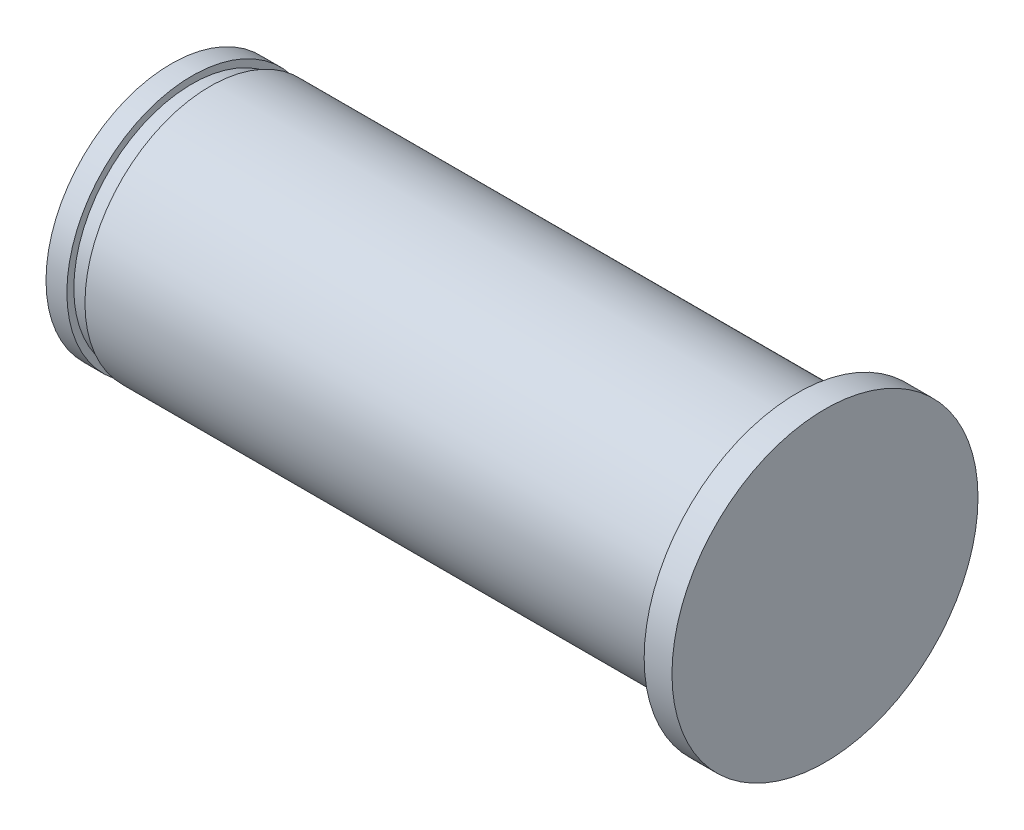
ISO-10303-21;
HEADER;
FILE_DESCRIPTION(('STEP AP214'),'2;1');
FILE_NAME('part.step','',(''),(''),'','','');
FILE_SCHEMA(('AUTOMOTIVE_DESIGN { 1 0 10303 214 1 1 1 1 }'));
ENDSEC;
DATA;
#1=APPLICATION_CONTEXT('core data for automotive mechanical design processes');
#2=APPLICATION_PROTOCOL_DEFINITION('international standard','automotive_design',2000,#1);
#3=PRODUCT_CONTEXT('',#1,'mechanical');
#4=PRODUCT('Part','Part','',(#3));
#5=PRODUCT_RELATED_PRODUCT_CATEGORY('part','',(#4));
#6=PRODUCT_DEFINITION_FORMATION('','',#4);
#7=PRODUCT_DEFINITION_CONTEXT('part definition',#1,'design');
#8=PRODUCT_DEFINITION('design','',#6,#7);
#9=PRODUCT_DEFINITION_SHAPE('','',#8);
#10=(LENGTH_UNIT() NAMED_UNIT(*) SI_UNIT(.MILLI.,.METRE.));
#11=(NAMED_UNIT(*) PLANE_ANGLE_UNIT() SI_UNIT($,.RADIAN.));
#12=(NAMED_UNIT(*) SI_UNIT($,.STERADIAN.) SOLID_ANGLE_UNIT());
#13=UNCERTAINTY_MEASURE_WITH_UNIT(LENGTH_MEASURE(1.E-05),#10,'distance_accuracy_value','');
#14=(GEOMETRIC_REPRESENTATION_CONTEXT(3) GLOBAL_UNCERTAINTY_ASSIGNED_CONTEXT((#13)) GLOBAL_UNIT_ASSIGNED_CONTEXT((#10,
#11,#12)) REPRESENTATION_CONTEXT('',''));
#15=CARTESIAN_POINT('',(0.,0.,0.));
#16=DIRECTION('',(0.,0.,1.));
#17=DIRECTION('',(1.,0.,0.));
#18=AXIS2_PLACEMENT_3D('',#15,#16,#17);
#19=CARTESIAN_POINT('',(0.,0.,0.));
#20=DIRECTION('',(1.,0.,0.));
#21=DIRECTION('',(0.,0.,-1.));
#22=AXIS2_PLACEMENT_3D('',#19,#20,#21);
#23=PLANE('',#22);
#24=CARTESIAN_POINT('',(0.,0.,0.));
#25=DIRECTION('',(-1.,0.,0.));
#26=DIRECTION('',(0.,0.,1.));
#27=AXIS2_PLACEMENT_3D('',#24,#25,#26);
#28=CIRCLE('',#27,9.);
#29=CARTESIAN_POINT('',(0.,0.,9.));
#30=VERTEX_POINT('',#29);
#31=EDGE_CURVE('E10',#30,#30,#28,.T.);
#32=ORIENTED_EDGE('',*,*,#31,.T.);
#33=EDGE_LOOP('',(#32));
#34=FACE_BOUND('',#33,.T.);
#35=ADVANCED_FACE('F43',(#34),#23,.F.);
#36=CARTESIAN_POINT('',(-20.4031201273256,0.,0.));
#37=DIRECTION('',(-1.,0.,0.));
#38=DIRECTION('',(0.,0.,1.));
#39=AXIS2_PLACEMENT_3D('',#36,#37,#38);
#40=CYLINDRICAL_SURFACE('',#39,9.);
#41=ORIENTED_EDGE('',*,*,#31,.F.);
#42=EDGE_LOOP('',(#41));
#43=FACE_BOUND('',#42,.T.);
#44=CARTESIAN_POINT('',(1.5,0.,0.));
#45=DIRECTION('',(-1.,0.,0.));
#46=DIRECTION('',(0.,0.,1.));
#47=AXIS2_PLACEMENT_3D('',#44,#45,#46);
#48=CIRCLE('',#47,9.);
#49=CARTESIAN_POINT('',(1.5,0.,9.));
#50=VERTEX_POINT('',#49);
#51=EDGE_CURVE('E50',#50,#50,#48,.T.);
#52=ORIENTED_EDGE('',*,*,#51,.T.);
#53=EDGE_LOOP('',(#52));
#54=FACE_BOUND('',#53,.T.);
#55=ADVANCED_FACE('F95',(#43,#54),#40,.T.);
#56=CARTESIAN_POINT('',(1.5,9.,0.));
#57=DIRECTION('',(-1.,0.,0.));
#58=DIRECTION('',(0.,0.,1.));
#59=AXIS2_PLACEMENT_3D('',#56,#57,#58);
#60=PLANE('',#59);
#61=ORIENTED_EDGE('',*,*,#51,.F.);
#62=EDGE_LOOP('',(#61));
#63=FACE_BOUND('',#62,.T.);
#64=CARTESIAN_POINT('',(1.5,0.,0.));
#65=DIRECTION('',(-1.,0.,0.));
#66=DIRECTION('',(0.,0.,1.));
#67=AXIS2_PLACEMENT_3D('',#64,#65,#66);
#68=CIRCLE('',#67,8.5);
#69=CARTESIAN_POINT('',(1.5,0.,8.5));
#70=VERTEX_POINT('',#69);
#71=EDGE_CURVE('E55',#70,#70,#68,.T.);
#72=ORIENTED_EDGE('',*,*,#71,.T.);
#73=EDGE_LOOP('',(#72));
#74=FACE_BOUND('',#73,.T.);
#75=ADVANCED_FACE('F99',(#63,#74),#60,.F.);
#76=CARTESIAN_POINT('',(-20.4031201273256,0.,0.));
#77=DIRECTION('',(-1.,0.,0.));
#78=DIRECTION('',(0.,0.,1.));
#79=AXIS2_PLACEMENT_3D('',#76,#77,#78);
#80=CYLINDRICAL_SURFACE('',#79,8.5);
#81=ORIENTED_EDGE('',*,*,#71,.F.);
#82=EDGE_LOOP('',(#81));
#83=FACE_BOUND('',#82,.T.);
#84=CARTESIAN_POINT('',(2.8,0.,0.));
#85=DIRECTION('',(-1.,0.,0.));
#86=DIRECTION('',(0.,0.,1.));
#87=AXIS2_PLACEMENT_3D('',#84,#85,#86);
#88=CIRCLE('',#87,8.5);
#89=CARTESIAN_POINT('',(2.8,0.,8.5));
#90=VERTEX_POINT('',#89);
#91=EDGE_CURVE('E60',#90,#90,#88,.T.);
#92=ORIENTED_EDGE('',*,*,#91,.T.);
#93=EDGE_LOOP('',(#92));
#94=FACE_BOUND('',#93,.T.);
#95=ADVANCED_FACE('F104',(#83,#94),#80,.T.);
#96=CARTESIAN_POINT('',(2.8,8.5,0.));
#97=DIRECTION('',(1.,0.,0.));
#98=DIRECTION('',(0.,0.,-1.));
#99=AXIS2_PLACEMENT_3D('',#96,#97,#98);
#100=PLANE('',#99);
#101=ORIENTED_EDGE('',*,*,#91,.F.);
#102=EDGE_LOOP('',(#101));
#103=FACE_BOUND('',#102,.T.);
#104=CARTESIAN_POINT('',(2.8,0.,0.));
#105=DIRECTION('',(-1.,0.,0.));
#106=DIRECTION('',(0.,0.,1.));
#107=AXIS2_PLACEMENT_3D('',#104,#105,#106);
#108=CIRCLE('',#107,9.);
#109=CARTESIAN_POINT('',(2.8,0.,9.));
#110=VERTEX_POINT('',#109);
#111=EDGE_CURVE('E66',#110,#110,#108,.T.);
#112=ORIENTED_EDGE('',*,*,#111,.T.);
#113=EDGE_LOOP('',(#112));
#114=FACE_BOUND('',#113,.T.);
#115=ADVANCED_FACE('F110',(#103,#114),#100,.F.);
#116=CARTESIAN_POINT('',(-20.4031201273256,0.,0.));
#117=DIRECTION('',(-1.,0.,0.));
#118=DIRECTION('',(0.,0.,1.));
#119=AXIS2_PLACEMENT_3D('',#116,#117,#118);
#120=CYLINDRICAL_SURFACE('',#119,9.);
#121=ORIENTED_EDGE('',*,*,#111,.F.);
#122=EDGE_LOOP('',(#121));
#123=FACE_BOUND('',#122,.T.);
#124=CARTESIAN_POINT('',(45.,0.,0.));
#125=DIRECTION('',(-1.,0.,0.));
#126=DIRECTION('',(0.,0.,1.));
#127=AXIS2_PLACEMENT_3D('',#124,#125,#126);
#128=CIRCLE('',#127,9.);
#129=CARTESIAN_POINT('',(45.,0.,9.));
#130=VERTEX_POINT('',#129);
#131=EDGE_CURVE('E70',#130,#130,#128,.T.);
#132=ORIENTED_EDGE('',*,*,#131,.T.);
#133=EDGE_LOOP('',(#132));
#134=FACE_BOUND('',#133,.T.);
#135=ADVANCED_FACE('F114',(#123,#134),#120,.T.);
#136=CARTESIAN_POINT('',(45.,9.,0.));
#137=DIRECTION('',(1.,0.,0.));
#138=DIRECTION('',(0.,0.,-1.));
#139=AXIS2_PLACEMENT_3D('',#136,#137,#138);
#140=PLANE('',#139);
#141=ORIENTED_EDGE('',*,*,#131,.F.);
#142=EDGE_LOOP('',(#141));
#143=FACE_BOUND('',#142,.T.);
#144=CARTESIAN_POINT('',(45.,0.,0.));
#145=DIRECTION('',(-1.,0.,0.));
#146=DIRECTION('',(0.,0.,1.));
#147=AXIS2_PLACEMENT_3D('',#144,#145,#146);
#148=CIRCLE('',#147,11.);
#149=CARTESIAN_POINT('',(45.,0.,11.));
#150=VERTEX_POINT('',#149);
#151=EDGE_CURVE('E74',#150,#150,#148,.T.);
#152=ORIENTED_EDGE('',*,*,#151,.T.);
#153=EDGE_LOOP('',(#152));
#154=FACE_BOUND('',#153,.T.);
#155=ADVANCED_FACE('F91',(#143,#154),#140,.F.);
#156=CARTESIAN_POINT('',(-20.4031201273256,0.,0.));
#157=DIRECTION('',(-1.,0.,0.));
#158=DIRECTION('',(0.,0.,1.));
#159=AXIS2_PLACEMENT_3D('',#156,#157,#158);
#160=CYLINDRICAL_SURFACE('',#159,11.);
#161=ORIENTED_EDGE('',*,*,#151,.F.);
#162=EDGE_LOOP('',(#161));
#163=FACE_BOUND('',#162,.T.);
#164=CARTESIAN_POINT('',(47.,0.,0.));
#165=DIRECTION('',(-1.,0.,0.));
#166=DIRECTION('',(0.,0.,1.));
#167=AXIS2_PLACEMENT_3D('',#164,#165,#166);
#168=CIRCLE('',#167,11.);
#169=CARTESIAN_POINT('',(47.,0.,11.));
#170=VERTEX_POINT('',#169);
#171=EDGE_CURVE('E78',#170,#170,#168,.T.);
#172=ORIENTED_EDGE('',*,*,#171,.T.);
#173=EDGE_LOOP('',(#172));
#174=FACE_BOUND('',#173,.T.);
#175=ADVANCED_FACE('F83',(#163,#174),#160,.T.);
#176=CARTESIAN_POINT('',(47.,11.,0.));
#177=DIRECTION('',(-1.,0.,0.));
#178=DIRECTION('',(0.,0.,1.));
#179=AXIS2_PLACEMENT_3D('',#176,#177,#178);
#180=PLANE('',#179);
#181=ORIENTED_EDGE('',*,*,#171,.F.);
#182=EDGE_LOOP('',(#181));
#183=FACE_BOUND('',#182,.T.);
#184=ADVANCED_FACE('F85',(#183),#180,.F.);
#185=CLOSED_SHELL('',(#35,#55,#75,#95,#115,#135,#155,#175,#184));
#186=MANIFOLD_SOLID_BREP('B2',#185);
#187=ADVANCED_BREP_SHAPE_REPRESENTATION('',(#18,#186),#14);
#188=SHAPE_DEFINITION_REPRESENTATION(#9,#187);
ENDSEC;
END-ISO-10303-21;
